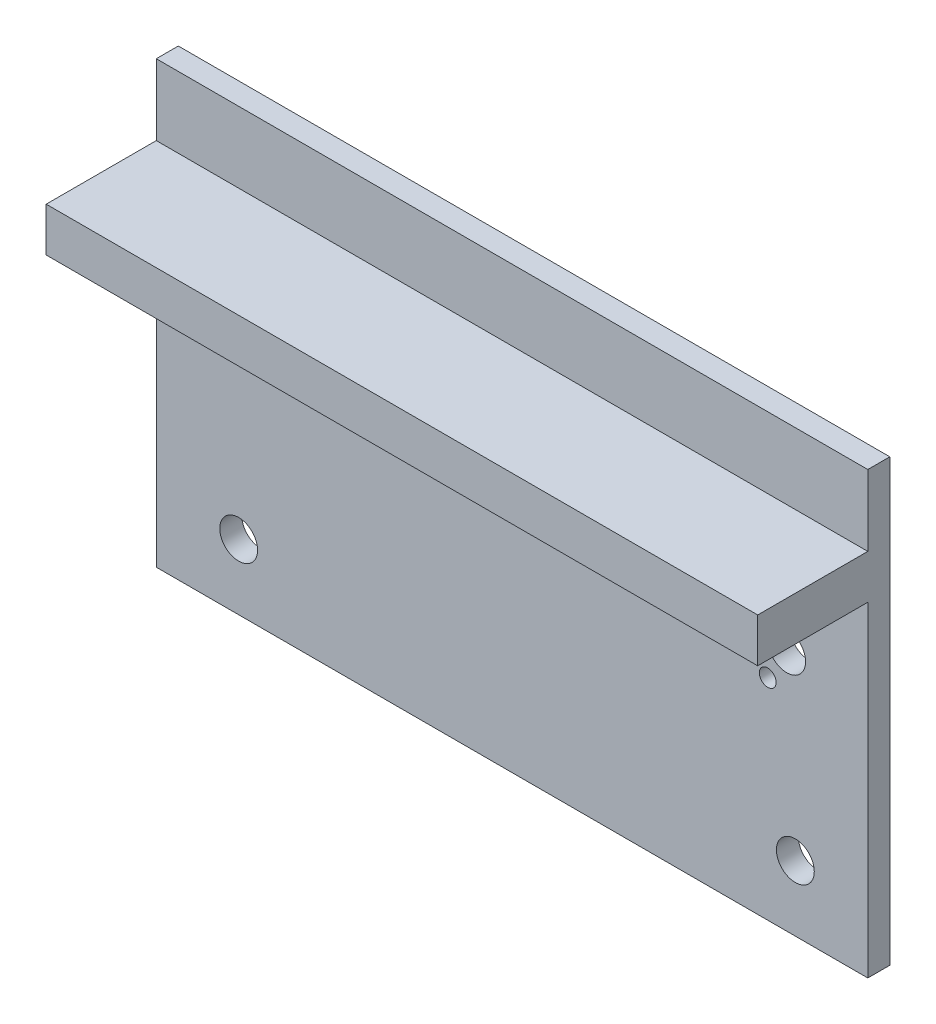
ISO-10303-21;
HEADER;
FILE_DESCRIPTION(('STEP AP214'),'2;1');
FILE_NAME('part.step','',(''),(''),'','','');
FILE_SCHEMA(('AUTOMOTIVE_DESIGN { 1 0 10303 214 1 1 1 1 }'));
ENDSEC;
DATA;
#1=APPLICATION_CONTEXT('core data for automotive mechanical design processes');
#2=APPLICATION_PROTOCOL_DEFINITION('international standard','automotive_design',2000,#1);
#3=PRODUCT_CONTEXT('',#1,'mechanical');
#4=PRODUCT('Part','Part','',(#3));
#5=PRODUCT_RELATED_PRODUCT_CATEGORY('part','',(#4));
#6=PRODUCT_DEFINITION_FORMATION('','',#4);
#7=PRODUCT_DEFINITION_CONTEXT('part definition',#1,'design');
#8=PRODUCT_DEFINITION('design','',#6,#7);
#9=PRODUCT_DEFINITION_SHAPE('','',#8);
#10=(LENGTH_UNIT() NAMED_UNIT(*) SI_UNIT(.MILLI.,.METRE.));
#11=(NAMED_UNIT(*) PLANE_ANGLE_UNIT() SI_UNIT($,.RADIAN.));
#12=(NAMED_UNIT(*) SI_UNIT($,.STERADIAN.) SOLID_ANGLE_UNIT());
#13=UNCERTAINTY_MEASURE_WITH_UNIT(LENGTH_MEASURE(1.E-05),#10,'distance_accuracy_value','');
#14=(GEOMETRIC_REPRESENTATION_CONTEXT(3) GLOBAL_UNCERTAINTY_ASSIGNED_CONTEXT((#13)) GLOBAL_UNIT_ASSIGNED_CONTEXT((#10,
#11,#12)) REPRESENTATION_CONTEXT('',''));
#15=CARTESIAN_POINT('',(0.,0.,0.));
#16=DIRECTION('',(0.,0.,1.));
#17=DIRECTION('',(1.,0.,0.));
#18=AXIS2_PLACEMENT_3D('',#15,#16,#17);
#19=CARTESIAN_POINT('',(0.,0.,0.));
#20=DIRECTION('',(0.,0.,1.));
#21=DIRECTION('',(1.,0.,0.));
#22=AXIS2_PLACEMENT_3D('',#19,#20,#21);
#23=PLANE('',#22);
#24=DIRECTION('',(1.,0.,0.));
#25=VECTOR('',#24,1.);
#26=CARTESIAN_POINT('',(-67.513940112486,-12.343644154343,0.));
#27=LINE('',#26,#25);
#28=CARTESIAN_POINT('',(-67.513940112486,-12.343644154343,0.));
#29=VERTEX_POINT('',#28);
#30=CARTESIAN_POINT('',(-2.88399462099449,-12.343644154343,0.));
#31=VERTEX_POINT('',#30);
#32=EDGE_CURVE('E54',#29,#31,#27,.T.);
#33=ORIENTED_EDGE('',*,*,#32,.F.);
#34=DIRECTION('',(0.,-1.,0.));
#35=VECTOR('',#34,1.);
#36=CARTESIAN_POINT('',(-67.513940112486,-1.90223017295272,0.));
#37=LINE('',#36,#35);
#38=CARTESIAN_POINT('',(-67.513940112486,-41.9022301729527,0.));
#39=VERTEX_POINT('',#38);
#40=EDGE_CURVE('E218',#29,#39,#37,.T.);
#41=ORIENTED_EDGE('',*,*,#40,.T.);
#42=DIRECTION('',(1.,0.,0.));
#43=VECTOR('',#42,1.);
#44=CARTESIAN_POINT('',(-67.513940112486,-41.9022301729527,0.));
#45=LINE('',#44,#43);
#46=CARTESIAN_POINT('',(-2.88399462099449,-41.9022301729527,0.));
#47=VERTEX_POINT('',#46);
#48=EDGE_CURVE('E186',#39,#47,#45,.T.);
#49=ORIENTED_EDGE('',*,*,#48,.T.);
#50=DIRECTION('',(0.,1.,0.));
#51=VECTOR('',#50,1.);
#52=CARTESIAN_POINT('',(-2.88399462099449,-1.90223017295271,0.));
#53=LINE('',#52,#51);
#54=EDGE_CURVE('E205',#47,#31,#53,.T.);
#55=ORIENTED_EDGE('',*,*,#54,.T.);
#56=EDGE_LOOP('',(#33,#41,#49,#55));
#57=FACE_BOUND('',#56,.T.);
#58=CARTESIAN_POINT('',(-10.2538044759369,-19.8511022065686,0.));
#59=DIRECTION('',(0.,0.,1.));
#60=DIRECTION('',(1.,0.,0.));
#61=AXIS2_PLACEMENT_3D('',#58,#59,#60);
#62=CIRCLE('',#61,1.71921989724716);
#63=CARTESIAN_POINT('',(-8.53458457868973,-19.8511022065686,0.));
#64=VERTEX_POINT('',#63);
#65=EDGE_CURVE('E173',#64,#64,#62,.T.);
#66=ORIENTED_EDGE('',*,*,#65,.F.);
#67=EDGE_LOOP('',(#66));
#68=FACE_BOUND('',#67,.T.);
#69=CARTESIAN_POINT('',(-9.46498593484701,-35.9657993348721,0.));
#70=DIRECTION('',(0.,0.,1.));
#71=DIRECTION('',(1.,0.,0.));
#72=AXIS2_PLACEMENT_3D('',#69,#70,#71);
#73=CIRCLE('',#72,1.71921989724716);
#74=CARTESIAN_POINT('',(-7.74576603759986,-35.9657993348721,0.));
#75=VERTEX_POINT('',#74);
#76=EDGE_CURVE('E167',#75,#75,#73,.T.);
#77=ORIENTED_EDGE('',*,*,#76,.F.);
#78=EDGE_LOOP('',(#77));
#79=FACE_BOUND('',#78,.T.);
#80=CARTESIAN_POINT('',(-58.9987450920031,-18.6951614750667,0.));
#81=DIRECTION('',(0.,0.,1.));
#82=DIRECTION('',(1.,0.,0.));
#83=AXIS2_PLACEMENT_3D('',#80,#81,#82);
#84=CIRCLE('',#83,1.71921989724716);
#85=CARTESIAN_POINT('',(-57.2795251947559,-18.6951614750667,0.));
#86=VERTEX_POINT('',#85);
#87=EDGE_CURVE('E161',#86,#86,#84,.T.);
#88=ORIENTED_EDGE('',*,*,#87,.F.);
#89=EDGE_LOOP('',(#88));
#90=FACE_BOUND('',#89,.T.);
#91=CARTESIAN_POINT('',(-60.0302770303514,-35.9657993348721,0.));
#92=DIRECTION('',(0.,0.,1.));
#93=DIRECTION('',(1.,0.,0.));
#94=AXIS2_PLACEMENT_3D('',#91,#92,#93);
#95=CIRCLE('',#94,1.71921989724716);
#96=CARTESIAN_POINT('',(-58.3110571331042,-35.9657993348721,0.));
#97=VERTEX_POINT('',#96);
#98=EDGE_CURVE('E156',#97,#97,#95,.T.);
#99=ORIENTED_EDGE('',*,*,#98,.F.);
#100=EDGE_LOOP('',(#99));
#101=FACE_BOUND('',#100,.T.);
#102=CARTESIAN_POINT('',(-11.973024373184,-22.8188236500409,0.));
#103=DIRECTION('',(0.,0.,1.));
#104=DIRECTION('',(1.,0.,0.));
#105=AXIS2_PLACEMENT_3D('',#102,#103,#104);
#106=CIRCLE('',#105,0.76287999780644);
#107=CARTESIAN_POINT('',(-11.2101443753776,-22.8188236500409,0.));
#108=VERTEX_POINT('',#107);
#109=EDGE_CURVE('E133',#108,#108,#106,.T.);
#110=ORIENTED_EDGE('',*,*,#109,.F.);
#111=EDGE_LOOP('',(#110));
#112=FACE_BOUND('',#111,.T.);
#113=ADVANCED_FACE('F37',(#57,#68,#79,#90,#101,#112),#23,.T.);
#114=CARTESIAN_POINT('',(-2.88399462099449,-1.90223017295271,-2.));
#115=DIRECTION('',(1.,0.,0.));
#116=DIRECTION('',(0.,0.,-1.));
#117=AXIS2_PLACEMENT_3D('',#114,#115,#116);
#118=PLANE('',#117);
#119=ORIENTED_EDGE('',*,*,#54,.F.);
#120=DIRECTION('',(0.,0.,1.));
#121=VECTOR('',#120,1.);
#122=CARTESIAN_POINT('',(-2.88399462099449,-41.9022301729527,-2.));
#123=LINE('',#122,#121);
#124=CARTESIAN_POINT('',(-2.88399462099449,-41.9022301729527,-2.));
#125=VERTEX_POINT('',#124);
#126=EDGE_CURVE('E11',#125,#47,#123,.T.);
#127=ORIENTED_EDGE('',*,*,#126,.F.);
#128=DIRECTION('',(0.,1.,0.));
#129=VECTOR('',#128,1.);
#130=CARTESIAN_POINT('',(-2.88399462099449,-1.90223017295271,-2.));
#131=LINE('',#130,#129);
#132=CARTESIAN_POINT('',(-2.88399462099449,-1.90223017295271,-2.));
#133=VERTEX_POINT('',#132);
#134=EDGE_CURVE('E181',#125,#133,#131,.T.);
#135=ORIENTED_EDGE('',*,*,#134,.T.);
#136=DIRECTION('',(0.,0.,1.));
#137=VECTOR('',#136,1.);
#138=CARTESIAN_POINT('',(-2.88399462099449,-1.90223017295271,-2.));
#139=LINE('',#138,#137);
#140=CARTESIAN_POINT('',(-2.88399462099449,-1.90223017295271,0.));
#141=VERTEX_POINT('',#140);
#142=EDGE_CURVE('E196',#133,#141,#139,.T.);
#143=ORIENTED_EDGE('',*,*,#142,.T.);
#144=CARTESIAN_POINT('',(-2.88399462099449,-8.34364415434304,0.));
#145=VERTEX_POINT('',#144);
#146=EDGE_CURVE('E131',#145,#141,#53,.T.);
#147=ORIENTED_EDGE('',*,*,#146,.F.);
#148=DIRECTION('',(0.,0.,-1.));
#149=VECTOR('',#148,1.);
#150=CARTESIAN_POINT('',(-2.88399462099449,-8.34364415434303,10.));
#151=LINE('',#150,#149);
#152=CARTESIAN_POINT('',(-2.88399462099449,-8.34364415434303,10.));
#153=VERTEX_POINT('',#152);
#154=EDGE_CURVE('E111',#153,#145,#151,.T.);
#155=ORIENTED_EDGE('',*,*,#154,.F.);
#156=DIRECTION('',(0.,1.,0.));
#157=VECTOR('',#156,1.);
#158=CARTESIAN_POINT('',(-2.88399462099449,-12.343644154343,10.));
#159=LINE('',#158,#157);
#160=CARTESIAN_POINT('',(-2.88399462099449,-12.343644154343,10.));
#161=VERTEX_POINT('',#160);
#162=EDGE_CURVE('E118',#161,#153,#159,.T.);
#163=ORIENTED_EDGE('',*,*,#162,.F.);
#164=DIRECTION('',(0.,0.,-1.));
#165=VECTOR('',#164,1.);
#166=CARTESIAN_POINT('',(-2.88399462099449,-12.343644154343,10.));
#167=LINE('',#166,#165);
#168=EDGE_CURVE('E148',#161,#31,#167,.T.);
#169=ORIENTED_EDGE('',*,*,#168,.T.);
#170=EDGE_LOOP('',(#119,#127,#135,#143,#147,#155,#163,#169));
#171=FACE_BOUND('',#170,.T.);
#172=ADVANCED_FACE('F39',(#171),#118,.T.);
#173=CARTESIAN_POINT('',(-67.513940112486,-41.9022301729527,-2.));
#174=DIRECTION('',(0.,-1.,0.));
#175=DIRECTION('',(0.,0.,-1.));
#176=AXIS2_PLACEMENT_3D('',#173,#174,#175);
#177=PLANE('',#176);
#178=ORIENTED_EDGE('',*,*,#48,.F.);
#179=DIRECTION('',(0.,0.,1.));
#180=VECTOR('',#179,1.);
#181=CARTESIAN_POINT('',(-67.513940112486,-41.9022301729527,-2.));
#182=LINE('',#181,#180);
#183=CARTESIAN_POINT('',(-67.513940112486,-41.9022301729527,-2.));
#184=VERTEX_POINT('',#183);
#185=EDGE_CURVE('E46',#184,#39,#182,.T.);
#186=ORIENTED_EDGE('',*,*,#185,.F.);
#187=DIRECTION('',(1.,0.,0.));
#188=VECTOR('',#187,1.);
#189=CARTESIAN_POINT('',(-67.513940112486,-41.9022301729527,-2.));
#190=LINE('',#189,#188);
#191=EDGE_CURVE('E193',#184,#125,#190,.T.);
#192=ORIENTED_EDGE('',*,*,#191,.T.);
#193=ORIENTED_EDGE('',*,*,#126,.T.);
#194=EDGE_LOOP('',(#178,#186,#192,#193));
#195=FACE_BOUND('',#194,.T.);
#196=ADVANCED_FACE('F252',(#195),#177,.T.);
#197=CARTESIAN_POINT('',(-67.513940112486,-1.90223017295272,-2.));
#198=DIRECTION('',(-1.,0.,0.));
#199=DIRECTION('',(0.,0.,1.));
#200=AXIS2_PLACEMENT_3D('',#197,#198,#199);
#201=PLANE('',#200);
#202=CARTESIAN_POINT('',(-67.513940112486,-1.90223017295272,0.));
#203=VERTEX_POINT('',#202);
#204=CARTESIAN_POINT('',(-67.513940112486,-8.34364415434304,0.));
#205=VERTEX_POINT('',#204);
#206=EDGE_CURVE('E214',#203,#205,#37,.T.);
#207=ORIENTED_EDGE('',*,*,#206,.F.);
#208=DIRECTION('',(0.,0.,1.));
#209=VECTOR('',#208,1.);
#210=CARTESIAN_POINT('',(-67.513940112486,-1.90223017295272,-2.));
#211=LINE('',#210,#209);
#212=CARTESIAN_POINT('',(-67.513940112486,-1.90223017295272,-2.));
#213=VERTEX_POINT('',#212);
#214=EDGE_CURVE('E209',#213,#203,#211,.T.);
#215=ORIENTED_EDGE('',*,*,#214,.F.);
#216=DIRECTION('',(0.,-1.,0.));
#217=VECTOR('',#216,1.);
#218=CARTESIAN_POINT('',(-67.513940112486,-1.90223017295272,-2.));
#219=LINE('',#218,#217);
#220=EDGE_CURVE('E190',#213,#184,#219,.T.);
#221=ORIENTED_EDGE('',*,*,#220,.T.);
#222=ORIENTED_EDGE('',*,*,#185,.T.);
#223=ORIENTED_EDGE('',*,*,#40,.F.);
#224=DIRECTION('',(0.,0.,-1.));
#225=VECTOR('',#224,1.);
#226=CARTESIAN_POINT('',(-67.513940112486,-12.343644154343,10.));
#227=LINE('',#226,#225);
#228=CARTESIAN_POINT('',(-67.513940112486,-12.343644154343,10.));
#229=VERTEX_POINT('',#228);
#230=EDGE_CURVE('E139',#229,#29,#227,.T.);
#231=ORIENTED_EDGE('',*,*,#230,.F.);
#232=DIRECTION('',(0.,-1.,0.));
#233=VECTOR('',#232,1.);
#234=CARTESIAN_POINT('',(-67.513940112486,-8.34364415434304,10.));
#235=LINE('',#234,#233);
#236=CARTESIAN_POINT('',(-67.513940112486,-8.34364415434304,10.));
#237=VERTEX_POINT('',#236);
#238=EDGE_CURVE('E117',#237,#229,#235,.T.);
#239=ORIENTED_EDGE('',*,*,#238,.F.);
#240=DIRECTION('',(0.,0.,-1.));
#241=VECTOR('',#240,1.);
#242=CARTESIAN_POINT('',(-67.513940112486,-8.34364415434304,10.));
#243=LINE('',#242,#241);
#244=EDGE_CURVE('E113',#237,#205,#243,.T.);
#245=ORIENTED_EDGE('',*,*,#244,.T.);
#246=EDGE_LOOP('',(#207,#215,#221,#222,#223,#231,#239,#245));
#247=FACE_BOUND('',#246,.T.);
#248=ADVANCED_FACE('F231',(#247),#201,.T.);
#249=CARTESIAN_POINT('',(-67.513940112486,-1.90223017295272,-2.));
#250=DIRECTION('',(0.,1.,0.));
#251=DIRECTION('',(-1.,0.,0.));
#252=AXIS2_PLACEMENT_3D('',#249,#250,#251);
#253=PLANE('',#252);
#254=DIRECTION('',(-1.,0.,0.));
#255=VECTOR('',#254,1.);
#256=CARTESIAN_POINT('',(-67.513940112486,-1.90223017295272,0.));
#257=LINE('',#256,#255);
#258=EDGE_CURVE('E199',#141,#203,#257,.T.);
#259=ORIENTED_EDGE('',*,*,#258,.F.);
#260=ORIENTED_EDGE('',*,*,#142,.F.);
#261=DIRECTION('',(-1.,0.,0.));
#262=VECTOR('',#261,1.);
#263=CARTESIAN_POINT('',(-67.513940112486,-1.90223017295272,-2.));
#264=LINE('',#263,#262);
#265=EDGE_CURVE('E185',#133,#213,#264,.T.);
#266=ORIENTED_EDGE('',*,*,#265,.T.);
#267=ORIENTED_EDGE('',*,*,#214,.T.);
#268=EDGE_LOOP('',(#259,#260,#266,#267));
#269=FACE_BOUND('',#268,.T.);
#270=ADVANCED_FACE('F227',(#269),#253,.T.);
#271=CARTESIAN_POINT('',(0.,0.,-2.));
#272=DIRECTION('',(0.,0.,1.));
#273=DIRECTION('',(1.,0.,0.));
#274=AXIS2_PLACEMENT_3D('',#271,#272,#273);
#275=PLANE('',#274);
#276=CARTESIAN_POINT('',(-11.973024373184,-22.8188236500409,-2.));
#277=DIRECTION('',(0.,0.,1.));
#278=DIRECTION('',(1.,0.,0.));
#279=AXIS2_PLACEMENT_3D('',#276,#277,#278);
#280=CIRCLE('',#279,0.76287999780644);
#281=CARTESIAN_POINT('',(-11.2101443753776,-22.8188236500409,-2.));
#282=VERTEX_POINT('',#281);
#283=EDGE_CURVE('E137',#282,#282,#280,.T.);
#284=ORIENTED_EDGE('',*,*,#283,.T.);
#285=EDGE_LOOP('',(#284));
#286=FACE_BOUND('',#285,.T.);
#287=CARTESIAN_POINT('',(-60.0302770303514,-35.9657993348721,-2.));
#288=DIRECTION('',(0.,0.,1.));
#289=DIRECTION('',(1.,0.,0.));
#290=AXIS2_PLACEMENT_3D('',#287,#288,#289);
#291=CIRCLE('',#290,1.71921989724716);
#292=CARTESIAN_POINT('',(-58.3110571331042,-35.9657993348721,-2.));
#293=VERTEX_POINT('',#292);
#294=EDGE_CURVE('E158',#293,#293,#291,.T.);
#295=ORIENTED_EDGE('',*,*,#294,.T.);
#296=EDGE_LOOP('',(#295));
#297=FACE_BOUND('',#296,.T.);
#298=CARTESIAN_POINT('',(-58.9987450920031,-18.6951614750667,-2.));
#299=DIRECTION('',(0.,0.,1.));
#300=DIRECTION('',(1.,0.,0.));
#301=AXIS2_PLACEMENT_3D('',#298,#299,#300);
#302=CIRCLE('',#301,1.71921989724716);
#303=CARTESIAN_POINT('',(-57.2795251947559,-18.6951614750667,-2.));
#304=VERTEX_POINT('',#303);
#305=EDGE_CURVE('E164',#304,#304,#302,.T.);
#306=ORIENTED_EDGE('',*,*,#305,.T.);
#307=EDGE_LOOP('',(#306));
#308=FACE_BOUND('',#307,.T.);
#309=CARTESIAN_POINT('',(-9.46498593484701,-35.9657993348721,-2.));
#310=DIRECTION('',(0.,0.,1.));
#311=DIRECTION('',(1.,0.,0.));
#312=AXIS2_PLACEMENT_3D('',#309,#310,#311);
#313=CIRCLE('',#312,1.71921989724716);
#314=CARTESIAN_POINT('',(-7.74576603759986,-35.9657993348721,-2.));
#315=VERTEX_POINT('',#314);
#316=EDGE_CURVE('E170',#315,#315,#313,.T.);
#317=ORIENTED_EDGE('',*,*,#316,.T.);
#318=EDGE_LOOP('',(#317));
#319=FACE_BOUND('',#318,.T.);
#320=CARTESIAN_POINT('',(-10.2538044759369,-19.8511022065686,-2.));
#321=DIRECTION('',(0.,0.,1.));
#322=DIRECTION('',(1.,0.,0.));
#323=AXIS2_PLACEMENT_3D('',#320,#321,#322);
#324=CIRCLE('',#323,1.71921989724716);
#325=CARTESIAN_POINT('',(-8.53458457868973,-19.8511022065686,-2.));
#326=VERTEX_POINT('',#325);
#327=EDGE_CURVE('E176',#326,#326,#324,.T.);
#328=ORIENTED_EDGE('',*,*,#327,.T.);
#329=EDGE_LOOP('',(#328));
#330=FACE_BOUND('',#329,.T.);
#331=ORIENTED_EDGE('',*,*,#134,.F.);
#332=ORIENTED_EDGE('',*,*,#191,.F.);
#333=ORIENTED_EDGE('',*,*,#220,.F.);
#334=ORIENTED_EDGE('',*,*,#265,.F.);
#335=EDGE_LOOP('',(#331,#332,#333,#334));
#336=FACE_BOUND('',#335,.T.);
#337=ADVANCED_FACE('F258',(#286,#297,#308,#319,#330,#336),#275,.F.);
#338=DIRECTION('',(-1.,0.,0.));
#339=VECTOR('',#338,1.);
#340=CARTESIAN_POINT('',(-2.88399462099449,-8.34364415434303,0.));
#341=LINE('',#340,#339);
#342=EDGE_CURVE('E64',#145,#205,#341,.T.);
#343=ORIENTED_EDGE('',*,*,#342,.F.);
#344=ORIENTED_EDGE('',*,*,#146,.T.);
#345=ORIENTED_EDGE('',*,*,#258,.T.);
#346=ORIENTED_EDGE('',*,*,#206,.T.);
#347=EDGE_LOOP('',(#343,#344,#345,#346));
#348=FACE_BOUND('',#347,.T.);
#349=ADVANCED_FACE('F225',(#348),#23,.T.);
#350=CARTESIAN_POINT('',(-10.2538044759369,-19.8511022065686,-2.));
#351=DIRECTION('',(0.,0.,1.));
#352=DIRECTION('',(1.,0.,0.));
#353=AXIS2_PLACEMENT_3D('',#350,#351,#352);
#354=CYLINDRICAL_SURFACE('',#353,1.71921989724716);
#355=ORIENTED_EDGE('',*,*,#327,.F.);
#356=EDGE_LOOP('',(#355));
#357=FACE_BOUND('',#356,.T.);
#358=ORIENTED_EDGE('',*,*,#65,.T.);
#359=EDGE_LOOP('',(#358));
#360=FACE_BOUND('',#359,.T.);
#361=ADVANCED_FACE('F257',(#357,#360),#354,.F.);
#362=CARTESIAN_POINT('',(-9.46498593484701,-35.9657993348721,-2.));
#363=DIRECTION('',(0.,0.,1.));
#364=DIRECTION('',(1.,0.,0.));
#365=AXIS2_PLACEMENT_3D('',#362,#363,#364);
#366=CYLINDRICAL_SURFACE('',#365,1.71921989724716);
#367=ORIENTED_EDGE('',*,*,#316,.F.);
#368=EDGE_LOOP('',(#367));
#369=FACE_BOUND('',#368,.T.);
#370=ORIENTED_EDGE('',*,*,#76,.T.);
#371=EDGE_LOOP('',(#370));
#372=FACE_BOUND('',#371,.T.);
#373=ADVANCED_FACE('F263',(#369,#372),#366,.F.);
#374=CARTESIAN_POINT('',(-58.9987450920031,-18.6951614750667,-2.));
#375=DIRECTION('',(0.,0.,1.));
#376=DIRECTION('',(1.,0.,0.));
#377=AXIS2_PLACEMENT_3D('',#374,#375,#376);
#378=CYLINDRICAL_SURFACE('',#377,1.71921989724716);
#379=ORIENTED_EDGE('',*,*,#305,.F.);
#380=EDGE_LOOP('',(#379));
#381=FACE_BOUND('',#380,.T.);
#382=ORIENTED_EDGE('',*,*,#87,.T.);
#383=EDGE_LOOP('',(#382));
#384=FACE_BOUND('',#383,.T.);
#385=ADVANCED_FACE('F274',(#381,#384),#378,.F.);
#386=CARTESIAN_POINT('',(-60.0302770303514,-35.9657993348721,-2.));
#387=DIRECTION('',(0.,0.,1.));
#388=DIRECTION('',(1.,0.,0.));
#389=AXIS2_PLACEMENT_3D('',#386,#387,#388);
#390=CYLINDRICAL_SURFACE('',#389,1.71921989724716);
#391=ORIENTED_EDGE('',*,*,#294,.F.);
#392=EDGE_LOOP('',(#391));
#393=FACE_BOUND('',#392,.T.);
#394=ORIENTED_EDGE('',*,*,#98,.T.);
#395=EDGE_LOOP('',(#394));
#396=FACE_BOUND('',#395,.T.);
#397=ADVANCED_FACE('F278',(#393,#396),#390,.F.);
#398=CARTESIAN_POINT('',(-11.973024373184,-22.8188236500409,-2.));
#399=DIRECTION('',(0.,0.,1.));
#400=DIRECTION('',(1.,0.,0.));
#401=AXIS2_PLACEMENT_3D('',#398,#399,#400);
#402=CYLINDRICAL_SURFACE('',#401,0.76287999780644);
#403=ORIENTED_EDGE('',*,*,#283,.F.);
#404=EDGE_LOOP('',(#403));
#405=FACE_BOUND('',#404,.T.);
#406=ORIENTED_EDGE('',*,*,#109,.T.);
#407=EDGE_LOOP('',(#406));
#408=FACE_BOUND('',#407,.T.);
#409=ADVANCED_FACE('F245',(#405,#408),#402,.F.);
#410=CARTESIAN_POINT('',(-2.88399462099449,-8.34364415434303,10.));
#411=DIRECTION('',(0.,-1.,0.));
#412=DIRECTION('',(1.,0.,0.));
#413=AXIS2_PLACEMENT_3D('',#410,#411,#412);
#414=PLANE('',#413);
#415=ORIENTED_EDGE('',*,*,#342,.T.);
#416=ORIENTED_EDGE('',*,*,#244,.F.);
#417=DIRECTION('',(-1.,0.,0.));
#418=VECTOR('',#417,1.);
#419=CARTESIAN_POINT('',(-2.88399462099449,-8.34364415434303,10.));
#420=LINE('',#419,#418);
#421=EDGE_CURVE('E107',#153,#237,#420,.T.);
#422=ORIENTED_EDGE('',*,*,#421,.F.);
#423=ORIENTED_EDGE('',*,*,#154,.T.);
#424=EDGE_LOOP('',(#415,#416,#422,#423));
#425=FACE_BOUND('',#424,.T.);
#426=ADVANCED_FACE('F109',(#425),#414,.F.);
#427=CARTESIAN_POINT('',(-67.513940112486,-12.343644154343,10.));
#428=DIRECTION('',(0.,1.,0.));
#429=DIRECTION('',(0.,0.,1.));
#430=AXIS2_PLACEMENT_3D('',#427,#428,#429);
#431=PLANE('',#430);
#432=ORIENTED_EDGE('',*,*,#32,.T.);
#433=ORIENTED_EDGE('',*,*,#168,.F.);
#434=DIRECTION('',(1.,0.,0.));
#435=VECTOR('',#434,1.);
#436=CARTESIAN_POINT('',(-67.513940112486,-12.343644154343,10.));
#437=LINE('',#436,#435);
#438=EDGE_CURVE('E123',#229,#161,#437,.T.);
#439=ORIENTED_EDGE('',*,*,#438,.F.);
#440=ORIENTED_EDGE('',*,*,#230,.T.);
#441=EDGE_LOOP('',(#432,#433,#439,#440));
#442=FACE_BOUND('',#441,.T.);
#443=ADVANCED_FACE('F237',(#442),#431,.F.);
#444=CARTESIAN_POINT('',(0.,0.,10.));
#445=DIRECTION('',(0.,0.,1.));
#446=DIRECTION('',(1.,0.,0.));
#447=AXIS2_PLACEMENT_3D('',#444,#445,#446);
#448=PLANE('',#447);
#449=ORIENTED_EDGE('',*,*,#162,.T.);
#450=ORIENTED_EDGE('',*,*,#421,.T.);
#451=ORIENTED_EDGE('',*,*,#238,.T.);
#452=ORIENTED_EDGE('',*,*,#438,.T.);
#453=EDGE_LOOP('',(#449,#450,#451,#452));
#454=FACE_BOUND('',#453,.T.);
#455=ADVANCED_FACE('F121',(#454),#448,.T.);
#456=CLOSED_SHELL('',(#113,#172,#196,#248,#270,#337,#349,#361,#373,#385,#397,#409,#426,#443,#455));
#457=MANIFOLD_SOLID_BREP('B2',#456);
#458=ADVANCED_BREP_SHAPE_REPRESENTATION('',(#18,#457),#14);
#459=SHAPE_DEFINITION_REPRESENTATION(#9,#458);
ENDSEC;
END-ISO-10303-21;
